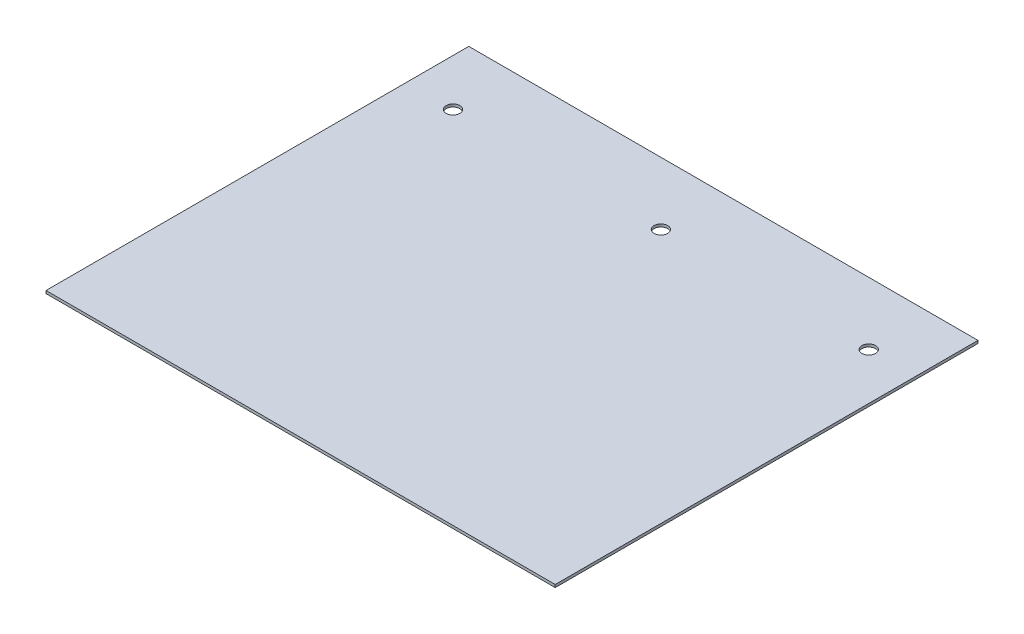
ISO-10303-21;
HEADER;
FILE_DESCRIPTION(('STEP AP214'),'2;1');
FILE_NAME('part.step','',(''),(''),'','','');
FILE_SCHEMA(('AUTOMOTIVE_DESIGN { 1 0 10303 214 1 1 1 1 }'));
ENDSEC;
DATA;
#1=APPLICATION_CONTEXT('core data for automotive mechanical design processes');
#2=APPLICATION_PROTOCOL_DEFINITION('international standard','automotive_design',2000,#1);
#3=PRODUCT_CONTEXT('',#1,'mechanical');
#4=PRODUCT('Part','Part','',(#3));
#5=PRODUCT_RELATED_PRODUCT_CATEGORY('part','',(#4));
#6=PRODUCT_DEFINITION_FORMATION('','',#4);
#7=PRODUCT_DEFINITION_CONTEXT('part definition',#1,'design');
#8=PRODUCT_DEFINITION('design','',#6,#7);
#9=PRODUCT_DEFINITION_SHAPE('','',#8);
#10=(LENGTH_UNIT() NAMED_UNIT(*) SI_UNIT(.MILLI.,.METRE.));
#11=(NAMED_UNIT(*) PLANE_ANGLE_UNIT() SI_UNIT($,.RADIAN.));
#12=(NAMED_UNIT(*) SI_UNIT($,.STERADIAN.) SOLID_ANGLE_UNIT());
#13=UNCERTAINTY_MEASURE_WITH_UNIT(LENGTH_MEASURE(1.E-05),#10,'distance_accuracy_value','');
#14=(GEOMETRIC_REPRESENTATION_CONTEXT(3) GLOBAL_UNCERTAINTY_ASSIGNED_CONTEXT((#13)) GLOBAL_UNIT_ASSIGNED_CONTEXT((#10,
#11,#12)) REPRESENTATION_CONTEXT('',''));
#15=CARTESIAN_POINT('',(0.,0.,0.));
#16=DIRECTION('',(0.,0.,1.));
#17=DIRECTION('',(1.,0.,0.));
#18=AXIS2_PLACEMENT_3D('',#15,#16,#17);
#19=CARTESIAN_POINT('',(186.69,-1.,0.));
#20=DIRECTION('',(-1.,0.,0.));
#21=DIRECTION('',(0.,0.,1.));
#22=AXIS2_PLACEMENT_3D('',#19,#20,#21);
#23=PLANE('',#22);
#24=DIRECTION('',(0.,0.,1.));
#25=VECTOR('',#24,1.);
#26=CARTESIAN_POINT('',(186.69,-1.,0.));
#27=LINE('',#26,#25);
#28=CARTESIAN_POINT('',(186.69,-1.,45.));
#29=VERTEX_POINT('',#28);
#30=CARTESIAN_POINT('',(186.69,-1.,199.9996));
#31=VERTEX_POINT('',#30);
#32=EDGE_CURVE('E63',#29,#31,#27,.T.);
#33=ORIENTED_EDGE('',*,*,#32,.F.);
#34=DIRECTION('',(0.,1.,0.));
#35=VECTOR('',#34,1.);
#36=CARTESIAN_POINT('',(186.69,-1.,45.));
#37=LINE('',#36,#35);
#38=CARTESIAN_POINT('',(186.69,0.,45.));
#39=VERTEX_POINT('',#38);
#40=EDGE_CURVE('E81',#29,#39,#37,.T.);
#41=ORIENTED_EDGE('',*,*,#40,.T.);
#42=DIRECTION('',(0.,0.,1.));
#43=VECTOR('',#42,1.);
#44=CARTESIAN_POINT('',(186.69,0.,0.));
#45=LINE('',#44,#43);
#46=CARTESIAN_POINT('',(186.69,0.,199.9996));
#47=VERTEX_POINT('',#46);
#48=EDGE_CURVE('E77',#39,#47,#45,.T.);
#49=ORIENTED_EDGE('',*,*,#48,.T.);
#50=DIRECTION('',(0.,1.,0.));
#51=VECTOR('',#50,1.);
#52=CARTESIAN_POINT('',(186.69,-1.,199.9996));
#53=LINE('',#52,#51);
#54=EDGE_CURVE('E11',#31,#47,#53,.T.);
#55=ORIENTED_EDGE('',*,*,#54,.F.);
#56=EDGE_LOOP('',(#33,#41,#49,#55));
#57=FACE_BOUND('',#56,.T.);
#58=ADVANCED_FACE('F39',(#57),#23,.F.);
#59=CARTESIAN_POINT('',(0.,-1.,199.9996));
#60=DIRECTION('',(0.,0.,1.));
#61=DIRECTION('',(1.,0.,0.));
#62=AXIS2_PLACEMENT_3D('',#59,#60,#61);
#63=PLANE('',#62);
#64=DIRECTION('',(1.,0.,0.));
#65=VECTOR('',#64,1.);
#66=CARTESIAN_POINT('',(0.,0.,199.9996));
#67=LINE('',#66,#65);
#68=CARTESIAN_POINT('',(0.,0.,199.9996));
#69=VERTEX_POINT('',#68);
#70=EDGE_CURVE('E91',#69,#47,#67,.T.);
#71=ORIENTED_EDGE('',*,*,#70,.F.);
#72=DIRECTION('',(0.,1.,0.));
#73=VECTOR('',#72,1.);
#74=CARTESIAN_POINT('',(0.,-1.,199.9996));
#75=LINE('',#74,#73);
#76=CARTESIAN_POINT('',(0.,-1.,199.9996));
#77=VERTEX_POINT('',#76);
#78=EDGE_CURVE('E43',#77,#69,#75,.T.);
#79=ORIENTED_EDGE('',*,*,#78,.F.);
#80=DIRECTION('',(1.,0.,0.));
#81=VECTOR('',#80,1.);
#82=CARTESIAN_POINT('',(0.,-1.,199.9996));
#83=LINE('',#82,#81);
#84=EDGE_CURVE('E92',#77,#31,#83,.T.);
#85=ORIENTED_EDGE('',*,*,#84,.T.);
#86=ORIENTED_EDGE('',*,*,#54,.T.);
#87=EDGE_LOOP('',(#71,#79,#85,#86));
#88=FACE_BOUND('',#87,.T.);
#89=ADVANCED_FACE('F89',(#88),#63,.T.);
#90=CARTESIAN_POINT('',(0.,-1.,0.));
#91=DIRECTION('',(-1.,0.,0.));
#92=DIRECTION('',(0.,0.,1.));
#93=AXIS2_PLACEMENT_3D('',#90,#91,#92);
#94=PLANE('',#93);
#95=DIRECTION('',(0.,1.,0.));
#96=VECTOR('',#95,1.);
#97=CARTESIAN_POINT('',(0.,-1.,45.));
#98=LINE('',#97,#96);
#99=CARTESIAN_POINT('',(0.,-1.,45.));
#100=VERTEX_POINT('',#99);
#101=CARTESIAN_POINT('',(0.,0.,45.));
#102=VERTEX_POINT('',#101);
#103=EDGE_CURVE('E54',#100,#102,#98,.T.);
#104=ORIENTED_EDGE('',*,*,#103,.F.);
#105=DIRECTION('',(0.,0.,1.));
#106=VECTOR('',#105,1.);
#107=CARTESIAN_POINT('',(0.,-1.,0.));
#108=LINE('',#107,#106);
#109=EDGE_CURVE('E113',#100,#77,#108,.T.);
#110=ORIENTED_EDGE('',*,*,#109,.T.);
#111=ORIENTED_EDGE('',*,*,#78,.T.);
#112=DIRECTION('',(0.,0.,1.));
#113=VECTOR('',#112,1.);
#114=CARTESIAN_POINT('',(0.,0.,0.));
#115=LINE('',#114,#113);
#116=EDGE_CURVE('E84',#102,#69,#115,.T.);
#117=ORIENTED_EDGE('',*,*,#116,.F.);
#118=EDGE_LOOP('',(#104,#110,#111,#117));
#119=FACE_BOUND('',#118,.T.);
#120=ADVANCED_FACE('F133',(#119),#94,.T.);
#121=CARTESIAN_POINT('',(93.345,-1.,67.9196));
#122=DIRECTION('',(0.,1.,0.));
#123=DIRECTION('',(0.,0.,1.));
#124=AXIS2_PLACEMENT_3D('',#121,#122,#123);
#125=CYLINDRICAL_SURFACE('',#124,2.50000000000001);
#126=CARTESIAN_POINT('',(93.345,-1.,67.9196));
#127=DIRECTION('',(0.,1.,0.));
#128=DIRECTION('',(0.,0.,1.));
#129=AXIS2_PLACEMENT_3D('',#126,#127,#128);
#130=CIRCLE('',#129,2.50000000000001);
#131=CARTESIAN_POINT('',(93.345,-1.,70.4196));
#132=VERTEX_POINT('',#131);
#133=EDGE_CURVE('E116',#132,#132,#130,.T.);
#134=ORIENTED_EDGE('',*,*,#133,.F.);
#135=EDGE_LOOP('',(#134));
#136=FACE_BOUND('',#135,.T.);
#137=CARTESIAN_POINT('',(93.345,0.,67.9196));
#138=DIRECTION('',(0.,1.,0.));
#139=DIRECTION('',(0.,0.,1.));
#140=AXIS2_PLACEMENT_3D('',#137,#138,#139);
#141=CIRCLE('',#140,2.50000000000001);
#142=CARTESIAN_POINT('',(93.345,0.,70.4196));
#143=VERTEX_POINT('',#142);
#144=EDGE_CURVE('E85',#143,#143,#141,.T.);
#145=ORIENTED_EDGE('',*,*,#144,.T.);
#146=EDGE_LOOP('',(#145));
#147=FACE_BOUND('',#146,.T.);
#148=ADVANCED_FACE('F135',(#136,#147),#125,.F.);
#149=CARTESIAN_POINT('',(17.145,-1.,67.9196));
#150=DIRECTION('',(0.,1.,0.));
#151=DIRECTION('',(0.,0.,1.));
#152=AXIS2_PLACEMENT_3D('',#149,#150,#151);
#153=CYLINDRICAL_SURFACE('',#152,2.50000000000001);
#154=CARTESIAN_POINT('',(17.145,-1.,67.9196));
#155=DIRECTION('',(0.,1.,0.));
#156=DIRECTION('',(0.,0.,1.));
#157=AXIS2_PLACEMENT_3D('',#154,#155,#156);
#158=CIRCLE('',#157,2.50000000000001);
#159=CARTESIAN_POINT('',(17.145,-1.,70.4196));
#160=VERTEX_POINT('',#159);
#161=EDGE_CURVE('E100',#160,#160,#158,.T.);
#162=ORIENTED_EDGE('',*,*,#161,.F.);
#163=EDGE_LOOP('',(#162));
#164=FACE_BOUND('',#163,.T.);
#165=CARTESIAN_POINT('',(17.145,0.,67.9196));
#166=DIRECTION('',(0.,1.,0.));
#167=DIRECTION('',(0.,0.,1.));
#168=AXIS2_PLACEMENT_3D('',#165,#166,#167);
#169=CIRCLE('',#168,2.50000000000001);
#170=CARTESIAN_POINT('',(17.145,0.,70.4196));
#171=VERTEX_POINT('',#170);
#172=EDGE_CURVE('E106',#171,#171,#169,.T.);
#173=ORIENTED_EDGE('',*,*,#172,.T.);
#174=EDGE_LOOP('',(#173));
#175=FACE_BOUND('',#174,.T.);
#176=ADVANCED_FACE('F141',(#164,#175),#153,.F.);
#177=CARTESIAN_POINT('',(169.545,-1.,67.9196));
#178=DIRECTION('',(0.,1.,0.));
#179=DIRECTION('',(0.,0.,1.));
#180=AXIS2_PLACEMENT_3D('',#177,#178,#179);
#181=CYLINDRICAL_SURFACE('',#180,2.50000000000002);
#182=CARTESIAN_POINT('',(169.545,-1.,67.9196));
#183=DIRECTION('',(0.,1.,0.));
#184=DIRECTION('',(0.,0.,1.));
#185=AXIS2_PLACEMENT_3D('',#182,#183,#184);
#186=CIRCLE('',#185,2.50000000000002);
#187=CARTESIAN_POINT('',(169.545,-1.,70.4196));
#188=VERTEX_POINT('',#187);
#189=EDGE_CURVE('E97',#188,#188,#186,.T.);
#190=ORIENTED_EDGE('',*,*,#189,.F.);
#191=EDGE_LOOP('',(#190));
#192=FACE_BOUND('',#191,.T.);
#193=CARTESIAN_POINT('',(169.545,0.,67.9196));
#194=DIRECTION('',(0.,1.,0.));
#195=DIRECTION('',(0.,0.,1.));
#196=AXIS2_PLACEMENT_3D('',#193,#194,#195);
#197=CIRCLE('',#196,2.50000000000002);
#198=CARTESIAN_POINT('',(169.545,0.,70.4196));
#199=VERTEX_POINT('',#198);
#200=EDGE_CURVE('E109',#199,#199,#197,.T.);
#201=ORIENTED_EDGE('',*,*,#200,.T.);
#202=EDGE_LOOP('',(#201));
#203=FACE_BOUND('',#202,.T.);
#204=ADVANCED_FACE('F41',(#192,#203),#181,.F.);
#205=CARTESIAN_POINT('',(0.,-1.,0.));
#206=DIRECTION('',(0.,1.,0.));
#207=DIRECTION('',(0.,0.,1.));
#208=AXIS2_PLACEMENT_3D('',#205,#206,#207);
#209=PLANE('',#208);
#210=ORIENTED_EDGE('',*,*,#189,.T.);
#211=EDGE_LOOP('',(#210));
#212=FACE_BOUND('',#211,.T.);
#213=ORIENTED_EDGE('',*,*,#161,.T.);
#214=EDGE_LOOP('',(#213));
#215=FACE_BOUND('',#214,.T.);
#216=ORIENTED_EDGE('',*,*,#133,.T.);
#217=EDGE_LOOP('',(#216));
#218=FACE_BOUND('',#217,.T.);
#219=ORIENTED_EDGE('',*,*,#109,.F.);
#220=DIRECTION('',(1.,0.,0.));
#221=VECTOR('',#220,1.);
#222=CARTESIAN_POINT('',(0.,-1.,45.));
#223=LINE('',#222,#221);
#224=EDGE_CURVE('E122',#100,#29,#223,.T.);
#225=ORIENTED_EDGE('',*,*,#224,.T.);
#226=ORIENTED_EDGE('',*,*,#32,.T.);
#227=ORIENTED_EDGE('',*,*,#84,.F.);
#228=EDGE_LOOP('',(#219,#225,#226,#227));
#229=FACE_BOUND('',#228,.T.);
#230=ADVANCED_FACE('F127',(#212,#215,#218,#229),#209,.F.);
#231=CARTESIAN_POINT('',(0.,0.,0.));
#232=DIRECTION('',(0.,1.,0.));
#233=DIRECTION('',(0.,0.,1.));
#234=AXIS2_PLACEMENT_3D('',#231,#232,#233);
#235=PLANE('',#234);
#236=DIRECTION('',(1.,0.,0.));
#237=VECTOR('',#236,1.);
#238=CARTESIAN_POINT('',(0.,0.,45.));
#239=LINE('',#238,#237);
#240=EDGE_CURVE('E124',#102,#39,#239,.T.);
#241=ORIENTED_EDGE('',*,*,#240,.F.);
#242=ORIENTED_EDGE('',*,*,#116,.T.);
#243=ORIENTED_EDGE('',*,*,#70,.T.);
#244=ORIENTED_EDGE('',*,*,#48,.F.);
#245=EDGE_LOOP('',(#241,#242,#243,#244));
#246=FACE_BOUND('',#245,.T.);
#247=ORIENTED_EDGE('',*,*,#200,.F.);
#248=EDGE_LOOP('',(#247));
#249=FACE_BOUND('',#248,.T.);
#250=ORIENTED_EDGE('',*,*,#172,.F.);
#251=EDGE_LOOP('',(#250));
#252=FACE_BOUND('',#251,.T.);
#253=ORIENTED_EDGE('',*,*,#144,.F.);
#254=EDGE_LOOP('',(#253));
#255=FACE_BOUND('',#254,.T.);
#256=ADVANCED_FACE('F93',(#246,#249,#252,#255),#235,.T.);
#257=CARTESIAN_POINT('',(0.,-1.,45.));
#258=DIRECTION('',(0.,0.,1.));
#259=DIRECTION('',(1.,0.,0.));
#260=AXIS2_PLACEMENT_3D('',#257,#258,#259);
#261=PLANE('',#260);
#262=ORIENTED_EDGE('',*,*,#240,.T.);
#263=ORIENTED_EDGE('',*,*,#40,.F.);
#264=ORIENTED_EDGE('',*,*,#224,.F.);
#265=ORIENTED_EDGE('',*,*,#103,.T.);
#266=EDGE_LOOP('',(#262,#263,#264,#265));
#267=FACE_BOUND('',#266,.T.);
#268=ADVANCED_FACE('F130',(#267),#261,.F.);
#269=CLOSED_SHELL('',(#58,#89,#120,#148,#176,#204,#230,#256,#268));
#270=MANIFOLD_SOLID_BREP('B2',#269);
#271=ADVANCED_BREP_SHAPE_REPRESENTATION('',(#18,#270),#14);
#272=SHAPE_DEFINITION_REPRESENTATION(#9,#271);
ENDSEC;
END-ISO-10303-21;
